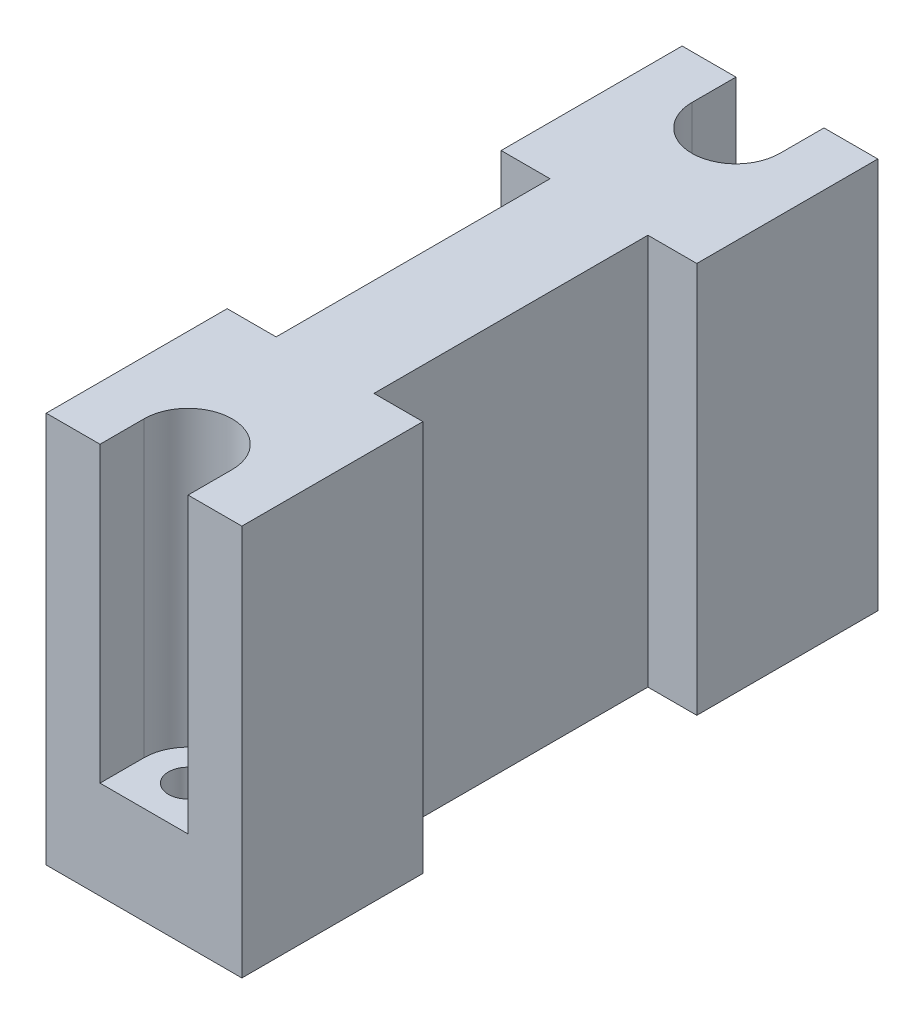
ISO-10303-21;
HEADER;
FILE_DESCRIPTION(('STEP AP214'),'2;1');
FILE_NAME('part.step','',(''),(''),'','','');
FILE_SCHEMA(('AUTOMOTIVE_DESIGN { 1 0 10303 214 1 1 1 1 }'));
ENDSEC;
DATA;
#1=APPLICATION_CONTEXT('core data for automotive mechanical design processes');
#2=APPLICATION_PROTOCOL_DEFINITION('international standard','automotive_design',2000,#1);
#3=PRODUCT_CONTEXT('',#1,'mechanical');
#4=PRODUCT('Part','Part','',(#3));
#5=PRODUCT_RELATED_PRODUCT_CATEGORY('part','',(#4));
#6=PRODUCT_DEFINITION_FORMATION('','',#4);
#7=PRODUCT_DEFINITION_CONTEXT('part definition',#1,'design');
#8=PRODUCT_DEFINITION('design','',#6,#7);
#9=PRODUCT_DEFINITION_SHAPE('','',#8);
#10=(LENGTH_UNIT() NAMED_UNIT(*) SI_UNIT(.MILLI.,.METRE.));
#11=(NAMED_UNIT(*) PLANE_ANGLE_UNIT() SI_UNIT($,.RADIAN.));
#12=(NAMED_UNIT(*) SI_UNIT($,.STERADIAN.) SOLID_ANGLE_UNIT());
#13=UNCERTAINTY_MEASURE_WITH_UNIT(LENGTH_MEASURE(1.E-05),#10,'distance_accuracy_value','');
#14=(GEOMETRIC_REPRESENTATION_CONTEXT(3) GLOBAL_UNCERTAINTY_ASSIGNED_CONTEXT((#13)) GLOBAL_UNIT_ASSIGNED_CONTEXT((#10,
#11,#12)) REPRESENTATION_CONTEXT('',''));
#15=CARTESIAN_POINT('',(0.,0.,0.));
#16=DIRECTION('',(0.,0.,1.));
#17=DIRECTION('',(1.,0.,0.));
#18=AXIS2_PLACEMENT_3D('',#15,#16,#17);
#19=CARTESIAN_POINT('',(0.,40.,-65.));
#20=DIRECTION('',(0.,0.,1.));
#21=DIRECTION('',(1.,0.,0.));
#22=AXIS2_PLACEMENT_3D('',#19,#20,#21);
#23=PLANE('',#22);
#24=DIRECTION('',(0.,1.,0.));
#25=VECTOR('',#24,1.);
#26=CARTESIAN_POINT('',(5.50000000000001,10.,-65.));
#27=LINE('',#26,#25);
#28=CARTESIAN_POINT('',(5.50000000000001,10.,-65.));
#29=VERTEX_POINT('',#28);
#30=CARTESIAN_POINT('',(5.50000000000001,40.,-65.));
#31=VERTEX_POINT('',#30);
#32=EDGE_CURVE('E274',#29,#31,#27,.T.);
#33=ORIENTED_EDGE('',*,*,#32,.F.);
#34=DIRECTION('',(1.,0.,0.));
#35=VECTOR('',#34,1.);
#36=CARTESIAN_POINT('',(5.50000000000001,10.,-65.));
#37=LINE('',#36,#35);
#38=CARTESIAN_POINT('',(14.5,10.,-65.));
#39=VERTEX_POINT('',#38);
#40=EDGE_CURVE('E288',#29,#39,#37,.T.);
#41=ORIENTED_EDGE('',*,*,#40,.T.);
#42=DIRECTION('',(0.,1.,0.));
#43=VECTOR('',#42,1.);
#44=CARTESIAN_POINT('',(14.5,10.,-65.));
#45=LINE('',#44,#43);
#46=CARTESIAN_POINT('',(14.5,40.,-65.));
#47=VERTEX_POINT('',#46);
#48=EDGE_CURVE('E270',#39,#47,#45,.T.);
#49=ORIENTED_EDGE('',*,*,#48,.T.);
#50=DIRECTION('',(-1.,0.,0.));
#51=VECTOR('',#50,1.);
#52=CARTESIAN_POINT('',(0.,40.,-65.));
#53=LINE('',#52,#51);
#54=CARTESIAN_POINT('',(20.,40.,-65.));
#55=VERTEX_POINT('',#54);
#56=EDGE_CURVE('E392',#55,#47,#53,.T.);
#57=ORIENTED_EDGE('',*,*,#56,.F.);
#58=DIRECTION('',(0.,-1.,0.));
#59=VECTOR('',#58,1.);
#60=CARTESIAN_POINT('',(20.,40.,-65.));
#61=LINE('',#60,#59);
#62=CARTESIAN_POINT('',(20.,0.,-65.));
#63=VERTEX_POINT('',#62);
#64=EDGE_CURVE('E415',#55,#63,#61,.T.);
#65=ORIENTED_EDGE('',*,*,#64,.T.);
#66=DIRECTION('',(-1.,0.,0.));
#67=VECTOR('',#66,1.);
#68=CARTESIAN_POINT('',(0.,0.,-65.));
#69=LINE('',#68,#67);
#70=CARTESIAN_POINT('',(0.,0.,-65.));
#71=VERTEX_POINT('',#70);
#72=EDGE_CURVE('E409',#63,#71,#69,.T.);
#73=ORIENTED_EDGE('',*,*,#72,.T.);
#74=DIRECTION('',(0.,-1.,0.));
#75=VECTOR('',#74,1.);
#76=CARTESIAN_POINT('',(0.,40.,-65.));
#77=LINE('',#76,#75);
#78=CARTESIAN_POINT('',(0.,40.,-65.));
#79=VERTEX_POINT('',#78);
#80=EDGE_CURVE('E396',#79,#71,#77,.T.);
#81=ORIENTED_EDGE('',*,*,#80,.F.);
#82=EDGE_CURVE('E391',#31,#79,#53,.T.);
#83=ORIENTED_EDGE('',*,*,#82,.F.);
#84=EDGE_LOOP('',(#33,#41,#49,#57,#65,#73,#81,#83));
#85=FACE_BOUND('',#84,.T.);
#86=ADVANCED_FACE('F69',(#85),#23,.F.);
#87=CARTESIAN_POINT('',(0.,40.,0.));
#88=DIRECTION('',(0.,-1.,0.));
#89=DIRECTION('',(0.,0.,-1.));
#90=AXIS2_PLACEMENT_3D('',#87,#88,#89);
#91=PLANE('',#90);
#92=DIRECTION('',(1.,0.,0.));
#93=VECTOR('',#92,1.);
#94=CARTESIAN_POINT('',(0.,40.,0.));
#95=LINE('',#94,#93);
#96=CARTESIAN_POINT('',(0.,40.,0.));
#97=VERTEX_POINT('',#96);
#98=CARTESIAN_POINT('',(5.5,40.,0.));
#99=VERTEX_POINT('',#98);
#100=EDGE_CURVE('E382',#97,#99,#95,.T.);
#101=ORIENTED_EDGE('',*,*,#100,.T.);
#102=DIRECTION('',(0.,0.,1.));
#103=VECTOR('',#102,1.);
#104=CARTESIAN_POINT('',(5.5,40.,-4.5));
#105=LINE('',#104,#103);
#106=CARTESIAN_POINT('',(5.5,40.,-4.5));
#107=VERTEX_POINT('',#106);
#108=EDGE_CURVE('E235',#107,#99,#105,.T.);
#109=ORIENTED_EDGE('',*,*,#108,.F.);
#110=CARTESIAN_POINT('',(10.,40.,-4.5));
#111=DIRECTION('',(0.,1.,0.));
#112=DIRECTION('',(0.,0.,1.));
#113=AXIS2_PLACEMENT_3D('',#110,#111,#112);
#114=CIRCLE('',#113,4.5);
#115=CARTESIAN_POINT('',(14.5,40.,-4.5));
#116=VERTEX_POINT('',#115);
#117=EDGE_CURVE('E228',#116,#107,#114,.T.);
#118=ORIENTED_EDGE('',*,*,#117,.F.);
#119=DIRECTION('',(0.,0.,1.));
#120=VECTOR('',#119,1.);
#121=CARTESIAN_POINT('',(14.5,40.,-4.5));
#122=LINE('',#121,#120);
#123=CARTESIAN_POINT('',(14.5,40.,0.));
#124=VERTEX_POINT('',#123);
#125=EDGE_CURVE('E87',#116,#124,#122,.T.);
#126=ORIENTED_EDGE('',*,*,#125,.T.);
#127=CARTESIAN_POINT('',(20.,40.,0.));
#128=VERTEX_POINT('',#127);
#129=EDGE_CURVE('E380',#124,#128,#95,.T.);
#130=ORIENTED_EDGE('',*,*,#129,.T.);
#131=DIRECTION('',(0.,0.,-1.));
#132=VECTOR('',#131,1.);
#133=CARTESIAN_POINT('',(20.,40.,0.));
#134=LINE('',#133,#132);
#135=CARTESIAN_POINT('',(20.,40.,-18.5));
#136=VERTEX_POINT('',#135);
#137=EDGE_CURVE('E387',#128,#136,#134,.T.);
#138=ORIENTED_EDGE('',*,*,#137,.T.);
#139=DIRECTION('',(1.,0.,0.));
#140=VECTOR('',#139,1.);
#141=CARTESIAN_POINT('',(20.,40.,-18.5));
#142=LINE('',#141,#140);
#143=CARTESIAN_POINT('',(15.,40.,-18.5));
#144=VERTEX_POINT('',#143);
#145=EDGE_CURVE('E300',#144,#136,#142,.T.);
#146=ORIENTED_EDGE('',*,*,#145,.F.);
#147=DIRECTION('',(0.,0.,1.));
#148=VECTOR('',#147,1.);
#149=CARTESIAN_POINT('',(15.,40.,-18.5));
#150=LINE('',#149,#148);
#151=CARTESIAN_POINT('',(15.,40.,-46.5));
#152=VERTEX_POINT('',#151);
#153=EDGE_CURVE('E313',#152,#144,#150,.T.);
#154=ORIENTED_EDGE('',*,*,#153,.F.);
#155=DIRECTION('',(-1.,0.,0.));
#156=VECTOR('',#155,1.);
#157=CARTESIAN_POINT('',(20.,40.,-46.5));
#158=LINE('',#157,#156);
#159=CARTESIAN_POINT('',(20.,40.,-46.5));
#160=VERTEX_POINT('',#159);
#161=EDGE_CURVE('E309',#160,#152,#158,.T.);
#162=ORIENTED_EDGE('',*,*,#161,.F.);
#163=EDGE_CURVE('E386',#160,#55,#134,.T.);
#164=ORIENTED_EDGE('',*,*,#163,.T.);
#165=ORIENTED_EDGE('',*,*,#56,.T.);
#166=DIRECTION('',(0.,0.,-1.));
#167=VECTOR('',#166,1.);
#168=CARTESIAN_POINT('',(14.5,40.,-60.5));
#169=LINE('',#168,#167);
#170=CARTESIAN_POINT('',(14.5,40.,-60.5));
#171=VERTEX_POINT('',#170);
#172=EDGE_CURVE('E265',#171,#47,#169,.T.);
#173=ORIENTED_EDGE('',*,*,#172,.F.);
#174=CARTESIAN_POINT('',(10.,40.,-60.5));
#175=DIRECTION('',(0.,1.,0.));
#176=DIRECTION('',(0.,0.,1.));
#177=AXIS2_PLACEMENT_3D('',#174,#175,#176);
#178=CIRCLE('',#177,4.5);
#179=CARTESIAN_POINT('',(5.50000000000001,40.,-60.5));
#180=VERTEX_POINT('',#179);
#181=EDGE_CURVE('E257',#180,#171,#178,.T.);
#182=ORIENTED_EDGE('',*,*,#181,.F.);
#183=DIRECTION('',(0.,0.,-1.));
#184=VECTOR('',#183,1.);
#185=CARTESIAN_POINT('',(5.50000000000001,40.,-60.5));
#186=LINE('',#185,#184);
#187=EDGE_CURVE('E95',#180,#31,#186,.T.);
#188=ORIENTED_EDGE('',*,*,#187,.T.);
#189=ORIENTED_EDGE('',*,*,#82,.T.);
#190=DIRECTION('',(0.,0.,1.));
#191=VECTOR('',#190,1.);
#192=CARTESIAN_POINT('',(0.,40.,0.));
#193=LINE('',#192,#191);
#194=CARTESIAN_POINT('',(0.,40.,-46.5));
#195=VERTEX_POINT('',#194);
#196=EDGE_CURVE('E376',#79,#195,#193,.T.);
#197=ORIENTED_EDGE('',*,*,#196,.T.);
#198=DIRECTION('',(-1.,0.,0.));
#199=VECTOR('',#198,1.);
#200=CARTESIAN_POINT('',(5.00000000000001,40.,-46.5));
#201=LINE('',#200,#199);
#202=CARTESIAN_POINT('',(5.00000000000001,40.,-46.5));
#203=VERTEX_POINT('',#202);
#204=EDGE_CURVE('E351',#203,#195,#201,.T.);
#205=ORIENTED_EDGE('',*,*,#204,.F.);
#206=DIRECTION('',(0.,0.,-1.));
#207=VECTOR('',#206,1.);
#208=CARTESIAN_POINT('',(5.00000000000001,40.,-18.5));
#209=LINE('',#208,#207);
#210=CARTESIAN_POINT('',(5.00000000000001,40.,-18.5));
#211=VERTEX_POINT('',#210);
#212=EDGE_CURVE('E347',#211,#203,#209,.T.);
#213=ORIENTED_EDGE('',*,*,#212,.F.);
#214=DIRECTION('',(1.,0.,0.));
#215=VECTOR('',#214,1.);
#216=CARTESIAN_POINT('',(5.00000000000001,40.,-18.5));
#217=LINE('',#216,#215);
#218=CARTESIAN_POINT('',(0.,40.,-18.5));
#219=VERTEX_POINT('',#218);
#220=EDGE_CURVE('E338',#219,#211,#217,.T.);
#221=ORIENTED_EDGE('',*,*,#220,.F.);
#222=EDGE_CURVE('E381',#219,#97,#193,.T.);
#223=ORIENTED_EDGE('',*,*,#222,.T.);
#224=EDGE_LOOP('',(#101,#109,#118,#126,#130,#138,#146,#154,#162,#164,#165,#173,#182,#188,#189,
#197,#205,#213,#221,#223));
#225=FACE_BOUND('',#224,.T.);
#226=ADVANCED_FACE('F445',(#225),#91,.F.);
#227=CARTESIAN_POINT('',(10.,0.,-60.5));
#228=DIRECTION('',(0.,1.,0.));
#229=DIRECTION('',(0.,0.,1.));
#230=AXIS2_PLACEMENT_3D('',#227,#228,#229);
#231=CYLINDRICAL_SURFACE('',#230,2.);
#232=CARTESIAN_POINT('',(10.,0.,-60.5));
#233=DIRECTION('',(0.,1.,0.));
#234=DIRECTION('',(0.,0.,1.));
#235=AXIS2_PLACEMENT_3D('',#232,#233,#234);
#236=CIRCLE('',#235,2.);
#237=CARTESIAN_POINT('',(10.,0.,-58.5));
#238=VERTEX_POINT('',#237);
#239=EDGE_CURVE('E352',#238,#238,#236,.T.);
#240=ORIENTED_EDGE('',*,*,#239,.F.);
#241=EDGE_LOOP('',(#240));
#242=FACE_BOUND('',#241,.T.);
#243=CARTESIAN_POINT('',(10.,10.,-60.5));
#244=DIRECTION('',(0.,1.,0.));
#245=DIRECTION('',(0.,0.,1.));
#246=AXIS2_PLACEMENT_3D('',#243,#244,#245);
#247=CIRCLE('',#246,2.);
#248=CARTESIAN_POINT('',(10.,10.,-58.5));
#249=VERTEX_POINT('',#248);
#250=EDGE_CURVE('E217',#249,#249,#247,.F.);
#251=ORIENTED_EDGE('',*,*,#250,.F.);
#252=EDGE_LOOP('',(#251));
#253=FACE_BOUND('',#252,.T.);
#254=ADVANCED_FACE('F451',(#242,#253),#231,.F.);
#255=CARTESIAN_POINT('',(0.,40.,0.));
#256=DIRECTION('',(1.,0.,0.));
#257=DIRECTION('',(0.,0.,-1.));
#258=AXIS2_PLACEMENT_3D('',#255,#256,#257);
#259=PLANE('',#258);
#260=ORIENTED_EDGE('',*,*,#222,.F.);
#261=DIRECTION('',(0.,1.,0.));
#262=VECTOR('',#261,1.);
#263=CARTESIAN_POINT('',(0.,0.,-18.5));
#264=LINE('',#263,#262);
#265=CARTESIAN_POINT('',(0.,0.,-18.5));
#266=VERTEX_POINT('',#265);
#267=EDGE_CURVE('E360',#266,#219,#264,.T.);
#268=ORIENTED_EDGE('',*,*,#267,.F.);
#269=DIRECTION('',(0.,0.,1.));
#270=VECTOR('',#269,1.);
#271=CARTESIAN_POINT('',(0.,0.,0.));
#272=LINE('',#271,#270);
#273=CARTESIAN_POINT('',(0.,0.,0.));
#274=VERTEX_POINT('',#273);
#275=EDGE_CURVE('E324',#266,#274,#272,.T.);
#276=ORIENTED_EDGE('',*,*,#275,.T.);
#277=DIRECTION('',(0.,-1.,0.));
#278=VECTOR('',#277,1.);
#279=CARTESIAN_POINT('',(0.,40.,0.));
#280=LINE('',#279,#278);
#281=EDGE_CURVE('E12',#97,#274,#280,.T.);
#282=ORIENTED_EDGE('',*,*,#281,.F.);
#283=EDGE_LOOP('',(#260,#268,#276,#282));
#284=FACE_BOUND('',#283,.T.);
#285=ADVANCED_FACE('F469',(#284),#259,.F.);
#286=CARTESIAN_POINT('',(20.,40.,0.));
#287=DIRECTION('',(-1.,0.,0.));
#288=DIRECTION('',(0.,0.,1.));
#289=AXIS2_PLACEMENT_3D('',#286,#287,#288);
#290=PLANE('',#289);
#291=DIRECTION('',(0.,0.,-1.));
#292=VECTOR('',#291,1.);
#293=CARTESIAN_POINT('',(20.,0.,0.));
#294=LINE('',#293,#292);
#295=CARTESIAN_POINT('',(20.,0.,0.));
#296=VERTEX_POINT('',#295);
#297=CARTESIAN_POINT('',(20.,0.,-18.5));
#298=VERTEX_POINT('',#297);
#299=EDGE_CURVE('E405',#296,#298,#294,.T.);
#300=ORIENTED_EDGE('',*,*,#299,.T.);
#301=DIRECTION('',(0.,1.,0.));
#302=VECTOR('',#301,1.);
#303=CARTESIAN_POINT('',(20.,0.,-18.5));
#304=LINE('',#303,#302);
#305=EDGE_CURVE('E320',#298,#136,#304,.T.);
#306=ORIENTED_EDGE('',*,*,#305,.T.);
#307=ORIENTED_EDGE('',*,*,#137,.F.);
#308=DIRECTION('',(0.,-1.,0.));
#309=VECTOR('',#308,1.);
#310=CARTESIAN_POINT('',(20.,40.,0.));
#311=LINE('',#310,#309);
#312=EDGE_CURVE('E79',#128,#296,#311,.T.);
#313=ORIENTED_EDGE('',*,*,#312,.T.);
#314=EDGE_LOOP('',(#300,#306,#307,#313));
#315=FACE_BOUND('',#314,.T.);
#316=ADVANCED_FACE('F462',(#315),#290,.F.);
#317=CARTESIAN_POINT('',(0.,0.,-46.5));
#318=VERTEX_POINT('',#317);
#319=EDGE_CURVE('E397',#71,#318,#272,.T.);
#320=ORIENTED_EDGE('',*,*,#319,.T.);
#321=DIRECTION('',(0.,1.,0.));
#322=VECTOR('',#321,1.);
#323=CARTESIAN_POINT('',(0.,0.,-46.5));
#324=LINE('',#323,#322);
#325=EDGE_CURVE('E363',#318,#195,#324,.T.);
#326=ORIENTED_EDGE('',*,*,#325,.T.);
#327=ORIENTED_EDGE('',*,*,#196,.F.);
#328=ORIENTED_EDGE('',*,*,#80,.T.);
#329=EDGE_LOOP('',(#320,#326,#327,#328));
#330=FACE_BOUND('',#329,.T.);
#331=ADVANCED_FACE('F71',(#330),#259,.F.);
#332=CARTESIAN_POINT('',(0.,40.,0.));
#333=DIRECTION('',(0.,0.,-1.));
#334=DIRECTION('',(-1.,0.,0.));
#335=AXIS2_PLACEMENT_3D('',#332,#333,#334);
#336=PLANE('',#335);
#337=DIRECTION('',(1.,0.,0.));
#338=VECTOR('',#337,1.);
#339=CARTESIAN_POINT('',(5.5,10.,0.));
#340=LINE('',#339,#338);
#341=CARTESIAN_POINT('',(5.5,10.,0.));
#342=VERTEX_POINT('',#341);
#343=CARTESIAN_POINT('',(14.5,10.,0.));
#344=VERTEX_POINT('',#343);
#345=EDGE_CURVE('E233',#342,#344,#340,.T.);
#346=ORIENTED_EDGE('',*,*,#345,.F.);
#347=DIRECTION('',(0.,1.,0.));
#348=VECTOR('',#347,1.);
#349=CARTESIAN_POINT('',(5.5,10.,0.));
#350=LINE('',#349,#348);
#351=EDGE_CURVE('E249',#342,#99,#350,.T.);
#352=ORIENTED_EDGE('',*,*,#351,.T.);
#353=ORIENTED_EDGE('',*,*,#100,.F.);
#354=ORIENTED_EDGE('',*,*,#281,.T.);
#355=DIRECTION('',(1.,0.,0.));
#356=VECTOR('',#355,1.);
#357=CARTESIAN_POINT('',(0.,0.,0.));
#358=LINE('',#357,#356);
#359=EDGE_CURVE('E401',#274,#296,#358,.T.);
#360=ORIENTED_EDGE('',*,*,#359,.T.);
#361=ORIENTED_EDGE('',*,*,#312,.F.);
#362=ORIENTED_EDGE('',*,*,#129,.F.);
#363=DIRECTION('',(0.,1.,0.));
#364=VECTOR('',#363,1.);
#365=CARTESIAN_POINT('',(14.5,10.,0.));
#366=LINE('',#365,#364);
#367=EDGE_CURVE('E218',#344,#124,#366,.T.);
#368=ORIENTED_EDGE('',*,*,#367,.F.);
#369=EDGE_LOOP('',(#346,#352,#353,#354,#360,#361,#362,#368));
#370=FACE_BOUND('',#369,.T.);
#371=ADVANCED_FACE('F460',(#370),#336,.F.);
#372=ORIENTED_EDGE('',*,*,#163,.F.);
#373=DIRECTION('',(0.,1.,0.));
#374=VECTOR('',#373,1.);
#375=CARTESIAN_POINT('',(20.,0.,-46.5));
#376=LINE('',#375,#374);
#377=CARTESIAN_POINT('',(20.,0.,-46.5));
#378=VERTEX_POINT('',#377);
#379=EDGE_CURVE('E308',#378,#160,#376,.T.);
#380=ORIENTED_EDGE('',*,*,#379,.F.);
#381=EDGE_CURVE('E404',#378,#63,#294,.T.);
#382=ORIENTED_EDGE('',*,*,#381,.T.);
#383=ORIENTED_EDGE('',*,*,#64,.F.);
#384=EDGE_LOOP('',(#372,#380,#382,#383));
#385=FACE_BOUND('',#384,.T.);
#386=ADVANCED_FACE('F458',(#385),#290,.F.);
#387=CARTESIAN_POINT('',(0.,0.,0.));
#388=DIRECTION('',(0.,-1.,0.));
#389=DIRECTION('',(0.,0.,-1.));
#390=AXIS2_PLACEMENT_3D('',#387,#388,#389);
#391=PLANE('',#390);
#392=DIRECTION('',(1.,0.,0.));
#393=VECTOR('',#392,1.);
#394=CARTESIAN_POINT('',(20.,0.,-18.5));
#395=LINE('',#394,#393);
#396=CARTESIAN_POINT('',(15.,0.,-18.5));
#397=VERTEX_POINT('',#396);
#398=EDGE_CURVE('E304',#397,#298,#395,.T.);
#399=ORIENTED_EDGE('',*,*,#398,.T.);
#400=ORIENTED_EDGE('',*,*,#299,.F.);
#401=ORIENTED_EDGE('',*,*,#359,.F.);
#402=ORIENTED_EDGE('',*,*,#275,.F.);
#403=DIRECTION('',(1.,0.,0.));
#404=VECTOR('',#403,1.);
#405=CARTESIAN_POINT('',(5.00000000000001,0.,-18.5));
#406=LINE('',#405,#404);
#407=CARTESIAN_POINT('',(5.00000000000001,0.,-18.5));
#408=VERTEX_POINT('',#407);
#409=EDGE_CURVE('E342',#266,#408,#406,.T.);
#410=ORIENTED_EDGE('',*,*,#409,.T.);
#411=DIRECTION('',(0.,0.,-1.));
#412=VECTOR('',#411,1.);
#413=CARTESIAN_POINT('',(5.00000000000001,0.,-18.5));
#414=LINE('',#413,#412);
#415=CARTESIAN_POINT('',(5.00000000000001,0.,-46.5));
#416=VERTEX_POINT('',#415);
#417=EDGE_CURVE('E333',#408,#416,#414,.T.);
#418=ORIENTED_EDGE('',*,*,#417,.T.);
#419=DIRECTION('',(-1.,0.,0.));
#420=VECTOR('',#419,1.);
#421=CARTESIAN_POINT('',(5.00000000000001,0.,-46.5));
#422=LINE('',#421,#420);
#423=EDGE_CURVE('E337',#416,#318,#422,.T.);
#424=ORIENTED_EDGE('',*,*,#423,.T.);
#425=ORIENTED_EDGE('',*,*,#319,.F.);
#426=ORIENTED_EDGE('',*,*,#72,.F.);
#427=ORIENTED_EDGE('',*,*,#381,.F.);
#428=DIRECTION('',(-1.,0.,0.));
#429=VECTOR('',#428,1.);
#430=CARTESIAN_POINT('',(20.,0.,-46.5));
#431=LINE('',#430,#429);
#432=CARTESIAN_POINT('',(15.,0.,-46.5));
#433=VERTEX_POINT('',#432);
#434=EDGE_CURVE('E295',#378,#433,#431,.T.);
#435=ORIENTED_EDGE('',*,*,#434,.T.);
#436=DIRECTION('',(0.,0.,1.));
#437=VECTOR('',#436,1.);
#438=CARTESIAN_POINT('',(15.,0.,-18.5));
#439=LINE('',#438,#437);
#440=EDGE_CURVE('E299',#433,#397,#439,.T.);
#441=ORIENTED_EDGE('',*,*,#440,.T.);
#442=EDGE_LOOP('',(#399,#400,#401,#402,#410,#418,#424,#425,#426,#427,#435,#441));
#443=FACE_BOUND('',#442,.T.);
#444=ORIENTED_EDGE('',*,*,#239,.T.);
#445=EDGE_LOOP('',(#444));
#446=FACE_BOUND('',#445,.T.);
#447=CARTESIAN_POINT('',(10.,0.,-4.5));
#448=DIRECTION('',(0.,1.,0.));
#449=DIRECTION('',(0.,0.,1.));
#450=AXIS2_PLACEMENT_3D('',#447,#448,#449);
#451=CIRCLE('',#450,2.);
#452=CARTESIAN_POINT('',(10.,0.,-2.5));
#453=VERTEX_POINT('',#452);
#454=EDGE_CURVE('E372',#453,#453,#451,.T.);
#455=ORIENTED_EDGE('',*,*,#454,.T.);
#456=EDGE_LOOP('',(#455));
#457=FACE_BOUND('',#456,.T.);
#458=ADVANCED_FACE('F457',(#443,#446,#457),#391,.T.);
#459=CARTESIAN_POINT('',(10.,0.,-4.5));
#460=DIRECTION('',(0.,1.,0.));
#461=DIRECTION('',(0.,0.,1.));
#462=AXIS2_PLACEMENT_3D('',#459,#460,#461);
#463=CYLINDRICAL_SURFACE('',#462,2.);
#464=CARTESIAN_POINT('',(10.,10.,-4.5));
#465=DIRECTION('',(0.,-1.,0.));
#466=DIRECTION('',(0.,0.,-1.));
#467=AXIS2_PLACEMENT_3D('',#464,#465,#466);
#468=CIRCLE('',#467,2.);
#469=CARTESIAN_POINT('',(10.,10.,-6.5));
#470=VERTEX_POINT('',#469);
#471=EDGE_CURVE('E73',#470,#470,#468,.F.);
#472=ORIENTED_EDGE('',*,*,#471,.T.);
#473=EDGE_LOOP('',(#472));
#474=FACE_BOUND('',#473,.T.);
#475=ORIENTED_EDGE('',*,*,#454,.F.);
#476=EDGE_LOOP('',(#475));
#477=FACE_BOUND('',#476,.T.);
#478=ADVANCED_FACE('F429',(#474,#477),#463,.F.);
#479=CARTESIAN_POINT('',(5.00000000000001,0.,-18.5));
#480=DIRECTION('',(1.,0.,0.));
#481=DIRECTION('',(0.,0.,-1.));
#482=AXIS2_PLACEMENT_3D('',#479,#480,#481);
#483=PLANE('',#482);
#484=ORIENTED_EDGE('',*,*,#212,.T.);
#485=DIRECTION('',(0.,1.,0.));
#486=VECTOR('',#485,1.);
#487=CARTESIAN_POINT('',(5.00000000000001,0.,-46.5));
#488=LINE('',#487,#486);
#489=EDGE_CURVE('E346',#416,#203,#488,.T.);
#490=ORIENTED_EDGE('',*,*,#489,.F.);
#491=ORIENTED_EDGE('',*,*,#417,.F.);
#492=DIRECTION('',(0.,1.,0.));
#493=VECTOR('',#492,1.);
#494=CARTESIAN_POINT('',(5.00000000000001,0.,-18.5));
#495=LINE('',#494,#493);
#496=EDGE_CURVE('E314',#408,#211,#495,.T.);
#497=ORIENTED_EDGE('',*,*,#496,.T.);
#498=EDGE_LOOP('',(#484,#490,#491,#497));
#499=FACE_BOUND('',#498,.T.);
#500=ADVANCED_FACE('F544',(#499),#483,.F.);
#501=CARTESIAN_POINT('',(5.00000000000001,0.,-18.5));
#502=DIRECTION('',(0.,0.,1.));
#503=DIRECTION('',(1.,0.,0.));
#504=AXIS2_PLACEMENT_3D('',#501,#502,#503);
#505=PLANE('',#504);
#506=ORIENTED_EDGE('',*,*,#220,.T.);
#507=ORIENTED_EDGE('',*,*,#496,.F.);
#508=ORIENTED_EDGE('',*,*,#409,.F.);
#509=ORIENTED_EDGE('',*,*,#267,.T.);
#510=EDGE_LOOP('',(#506,#507,#508,#509));
#511=FACE_BOUND('',#510,.T.);
#512=ADVANCED_FACE('F541',(#511),#505,.F.);
#513=CARTESIAN_POINT('',(5.00000000000001,0.,-46.5));
#514=DIRECTION('',(0.,0.,-1.));
#515=DIRECTION('',(-1.,0.,0.));
#516=AXIS2_PLACEMENT_3D('',#513,#514,#515);
#517=PLANE('',#516);
#518=ORIENTED_EDGE('',*,*,#204,.T.);
#519=ORIENTED_EDGE('',*,*,#325,.F.);
#520=ORIENTED_EDGE('',*,*,#423,.F.);
#521=ORIENTED_EDGE('',*,*,#489,.T.);
#522=EDGE_LOOP('',(#518,#519,#520,#521));
#523=FACE_BOUND('',#522,.T.);
#524=ADVANCED_FACE('F536',(#523),#517,.F.);
#525=CARTESIAN_POINT('',(20.,0.,-18.5));
#526=DIRECTION('',(0.,0.,1.));
#527=DIRECTION('',(1.,0.,0.));
#528=AXIS2_PLACEMENT_3D('',#525,#526,#527);
#529=PLANE('',#528);
#530=ORIENTED_EDGE('',*,*,#145,.T.);
#531=ORIENTED_EDGE('',*,*,#305,.F.);
#532=ORIENTED_EDGE('',*,*,#398,.F.);
#533=DIRECTION('',(0.,1.,0.));
#534=VECTOR('',#533,1.);
#535=CARTESIAN_POINT('',(15.,0.,-18.5));
#536=LINE('',#535,#534);
#537=EDGE_CURVE('E325',#397,#144,#536,.T.);
#538=ORIENTED_EDGE('',*,*,#537,.T.);
#539=EDGE_LOOP('',(#530,#531,#532,#538));
#540=FACE_BOUND('',#539,.T.);
#541=ADVANCED_FACE('F491',(#540),#529,.F.);
#542=CARTESIAN_POINT('',(15.,0.,-18.5));
#543=DIRECTION('',(-1.,0.,0.));
#544=DIRECTION('',(0.,0.,1.));
#545=AXIS2_PLACEMENT_3D('',#542,#543,#544);
#546=PLANE('',#545);
#547=ORIENTED_EDGE('',*,*,#153,.T.);
#548=ORIENTED_EDGE('',*,*,#537,.F.);
#549=ORIENTED_EDGE('',*,*,#440,.F.);
#550=DIRECTION('',(0.,1.,0.));
#551=VECTOR('',#550,1.);
#552=CARTESIAN_POINT('',(15.,0.,-46.5));
#553=LINE('',#552,#551);
#554=EDGE_CURVE('E328',#433,#152,#553,.T.);
#555=ORIENTED_EDGE('',*,*,#554,.T.);
#556=EDGE_LOOP('',(#547,#548,#549,#555));
#557=FACE_BOUND('',#556,.T.);
#558=ADVANCED_FACE('F494',(#557),#546,.F.);
#559=CARTESIAN_POINT('',(20.,0.,-46.5));
#560=DIRECTION('',(0.,0.,-1.));
#561=DIRECTION('',(-1.,0.,0.));
#562=AXIS2_PLACEMENT_3D('',#559,#560,#561);
#563=PLANE('',#562);
#564=ORIENTED_EDGE('',*,*,#161,.T.);
#565=ORIENTED_EDGE('',*,*,#554,.F.);
#566=ORIENTED_EDGE('',*,*,#434,.F.);
#567=ORIENTED_EDGE('',*,*,#379,.T.);
#568=EDGE_LOOP('',(#564,#565,#566,#567));
#569=FACE_BOUND('',#568,.T.);
#570=ADVANCED_FACE('F497',(#569),#563,.F.);
#571=CARTESIAN_POINT('',(0.,10.,0.));
#572=DIRECTION('',(0.,1.,0.));
#573=DIRECTION('',(0.,0.,1.));
#574=AXIS2_PLACEMENT_3D('',#571,#572,#573);
#575=PLANE('',#574);
#576=DIRECTION('',(0.,0.,-1.));
#577=VECTOR('',#576,1.);
#578=CARTESIAN_POINT('',(5.50000000000001,10.,-60.5));
#579=LINE('',#578,#577);
#580=CARTESIAN_POINT('',(5.50000000000001,10.,-60.5));
#581=VERTEX_POINT('',#580);
#582=EDGE_CURVE('E269',#581,#29,#579,.T.);
#583=ORIENTED_EDGE('',*,*,#582,.F.);
#584=CARTESIAN_POINT('',(10.,10.,-60.5));
#585=DIRECTION('',(0.,1.,0.));
#586=DIRECTION('',(0.,0.,1.));
#587=AXIS2_PLACEMENT_3D('',#584,#585,#586);
#588=CIRCLE('',#587,4.5);
#589=CARTESIAN_POINT('',(14.5,10.,-60.5));
#590=VERTEX_POINT('',#589);
#591=EDGE_CURVE('E261',#581,#590,#588,.T.);
#592=ORIENTED_EDGE('',*,*,#591,.T.);
#593=DIRECTION('',(0.,0.,-1.));
#594=VECTOR('',#593,1.);
#595=CARTESIAN_POINT('',(14.5,10.,-60.5));
#596=LINE('',#595,#594);
#597=EDGE_CURVE('E282',#590,#39,#596,.T.);
#598=ORIENTED_EDGE('',*,*,#597,.T.);
#599=ORIENTED_EDGE('',*,*,#40,.F.);
#600=EDGE_LOOP('',(#583,#592,#598,#599));
#601=FACE_BOUND('',#600,.T.);
#602=ORIENTED_EDGE('',*,*,#250,.T.);
#603=EDGE_LOOP('',(#602));
#604=FACE_BOUND('',#603,.T.);
#605=ADVANCED_FACE('F521',(#601,#604),#575,.T.);
#606=CARTESIAN_POINT('',(5.50000000000001,10.,-60.5));
#607=DIRECTION('',(1.,0.,0.));
#608=DIRECTION('',(0.,0.,-1.));
#609=AXIS2_PLACEMENT_3D('',#606,#607,#608);
#610=PLANE('',#609);
#611=ORIENTED_EDGE('',*,*,#187,.F.);
#612=DIRECTION('',(0.,1.,0.));
#613=VECTOR('',#612,1.);
#614=CARTESIAN_POINT('',(5.50000000000001,10.,-60.5));
#615=LINE('',#614,#613);
#616=EDGE_CURVE('E277',#581,#180,#615,.T.);
#617=ORIENTED_EDGE('',*,*,#616,.F.);
#618=ORIENTED_EDGE('',*,*,#582,.T.);
#619=ORIENTED_EDGE('',*,*,#32,.T.);
#620=EDGE_LOOP('',(#611,#617,#618,#619));
#621=FACE_BOUND('',#620,.T.);
#622=ADVANCED_FACE('F519',(#621),#610,.T.);
#623=CARTESIAN_POINT('',(14.5,10.,-60.5));
#624=DIRECTION('',(1.,0.,0.));
#625=DIRECTION('',(0.,0.,-1.));
#626=AXIS2_PLACEMENT_3D('',#623,#624,#625);
#627=PLANE('',#626);
#628=ORIENTED_EDGE('',*,*,#172,.T.);
#629=ORIENTED_EDGE('',*,*,#48,.F.);
#630=ORIENTED_EDGE('',*,*,#597,.F.);
#631=DIRECTION('',(0.,1.,0.));
#632=VECTOR('',#631,1.);
#633=CARTESIAN_POINT('',(14.5,10.,-60.5));
#634=LINE('',#633,#632);
#635=EDGE_CURVE('E266',#590,#171,#634,.T.);
#636=ORIENTED_EDGE('',*,*,#635,.T.);
#637=EDGE_LOOP('',(#628,#629,#630,#636));
#638=FACE_BOUND('',#637,.T.);
#639=ADVANCED_FACE('F441',(#638),#627,.F.);
#640=CARTESIAN_POINT('',(10.,10.,-60.5));
#641=DIRECTION('',(0.,1.,0.));
#642=DIRECTION('',(0.,0.,1.));
#643=AXIS2_PLACEMENT_3D('',#640,#641,#642);
#644=CYLINDRICAL_SURFACE('',#643,4.5);
#645=ORIENTED_EDGE('',*,*,#616,.T.);
#646=ORIENTED_EDGE('',*,*,#181,.T.);
#647=ORIENTED_EDGE('',*,*,#635,.F.);
#648=ORIENTED_EDGE('',*,*,#591,.F.);
#649=EDGE_LOOP('',(#645,#646,#647,#648));
#650=FACE_BOUND('',#649,.T.);
#651=ADVANCED_FACE('F433',(#650),#644,.F.);
#652=CARTESIAN_POINT('',(0.,10.,0.));
#653=DIRECTION('',(0.,-1.,0.));
#654=DIRECTION('',(0.,0.,-1.));
#655=AXIS2_PLACEMENT_3D('',#652,#653,#654);
#656=PLANE('',#655);
#657=DIRECTION('',(0.,0.,1.));
#658=VECTOR('',#657,1.);
#659=CARTESIAN_POINT('',(5.5,10.,-4.5));
#660=LINE('',#659,#658);
#661=CARTESIAN_POINT('',(5.5,10.,-4.5));
#662=VERTEX_POINT('',#661);
#663=EDGE_CURVE('E239',#662,#342,#660,.T.);
#664=ORIENTED_EDGE('',*,*,#663,.T.);
#665=ORIENTED_EDGE('',*,*,#345,.T.);
#666=DIRECTION('',(0.,0.,1.));
#667=VECTOR('',#666,1.);
#668=CARTESIAN_POINT('',(14.5,10.,-4.5));
#669=LINE('',#668,#667);
#670=CARTESIAN_POINT('',(14.5,10.,-4.5));
#671=VERTEX_POINT('',#670);
#672=EDGE_CURVE('E211',#671,#344,#669,.T.);
#673=ORIENTED_EDGE('',*,*,#672,.F.);
#674=CARTESIAN_POINT('',(10.,10.,-4.5));
#675=DIRECTION('',(0.,1.,0.));
#676=DIRECTION('',(0.,0.,1.));
#677=AXIS2_PLACEMENT_3D('',#674,#675,#676);
#678=CIRCLE('',#677,4.5);
#679=EDGE_CURVE('E221',#671,#662,#678,.T.);
#680=ORIENTED_EDGE('',*,*,#679,.T.);
#681=EDGE_LOOP('',(#664,#665,#673,#680));
#682=FACE_BOUND('',#681,.T.);
#683=ORIENTED_EDGE('',*,*,#471,.F.);
#684=EDGE_LOOP('',(#683));
#685=FACE_BOUND('',#684,.T.);
#686=ADVANCED_FACE('F230',(#682,#685),#656,.F.);
#687=CARTESIAN_POINT('',(5.5,10.,-4.5));
#688=DIRECTION('',(-1.,0.,0.));
#689=DIRECTION('',(0.,0.,1.));
#690=AXIS2_PLACEMENT_3D('',#687,#688,#689);
#691=PLANE('',#690);
#692=ORIENTED_EDGE('',*,*,#108,.T.);
#693=ORIENTED_EDGE('',*,*,#351,.F.);
#694=ORIENTED_EDGE('',*,*,#663,.F.);
#695=DIRECTION('',(0.,1.,0.));
#696=VECTOR('',#695,1.);
#697=CARTESIAN_POINT('',(5.5,10.,-4.5));
#698=LINE('',#697,#696);
#699=EDGE_CURVE('E223',#662,#107,#698,.T.);
#700=ORIENTED_EDGE('',*,*,#699,.T.);
#701=EDGE_LOOP('',(#692,#693,#694,#700));
#702=FACE_BOUND('',#701,.T.);
#703=ADVANCED_FACE('F432',(#702),#691,.F.);
#704=CARTESIAN_POINT('',(14.5,10.,-4.5));
#705=DIRECTION('',(-1.,0.,0.));
#706=DIRECTION('',(0.,0.,1.));
#707=AXIS2_PLACEMENT_3D('',#704,#705,#706);
#708=PLANE('',#707);
#709=ORIENTED_EDGE('',*,*,#125,.F.);
#710=DIRECTION('',(0.,1.,0.));
#711=VECTOR('',#710,1.);
#712=CARTESIAN_POINT('',(14.5,10.,-4.5));
#713=LINE('',#712,#711);
#714=EDGE_CURVE('E207',#671,#116,#713,.T.);
#715=ORIENTED_EDGE('',*,*,#714,.F.);
#716=ORIENTED_EDGE('',*,*,#672,.T.);
#717=ORIENTED_EDGE('',*,*,#367,.T.);
#718=EDGE_LOOP('',(#709,#715,#716,#717));
#719=FACE_BOUND('',#718,.T.);
#720=ADVANCED_FACE('F209',(#719),#708,.T.);
#721=CARTESIAN_POINT('',(10.,10.,-4.5));
#722=DIRECTION('',(0.,1.,0.));
#723=DIRECTION('',(0.,0.,1.));
#724=AXIS2_PLACEMENT_3D('',#721,#722,#723);
#725=CYLINDRICAL_SURFACE('',#724,4.5);
#726=ORIENTED_EDGE('',*,*,#714,.T.);
#727=ORIENTED_EDGE('',*,*,#117,.T.);
#728=ORIENTED_EDGE('',*,*,#699,.F.);
#729=ORIENTED_EDGE('',*,*,#679,.F.);
#730=EDGE_LOOP('',(#726,#727,#728,#729));
#731=FACE_BOUND('',#730,.T.);
#732=ADVANCED_FACE('F222',(#731),#725,.F.);
#733=CLOSED_SHELL('',(#86,#226,#254,#285,#316,#331,#371,#386,#458,#478,#500,#512,#524,#541,#558,
#570,#605,#622,#639,#651,#686,#703,#720,#732));
#734=MANIFOLD_SOLID_BREP('B2',#733);
#735=ADVANCED_BREP_SHAPE_REPRESENTATION('',(#18,#734),#14);
#736=SHAPE_DEFINITION_REPRESENTATION(#9,#735);
ENDSEC;
END-ISO-10303-21;
